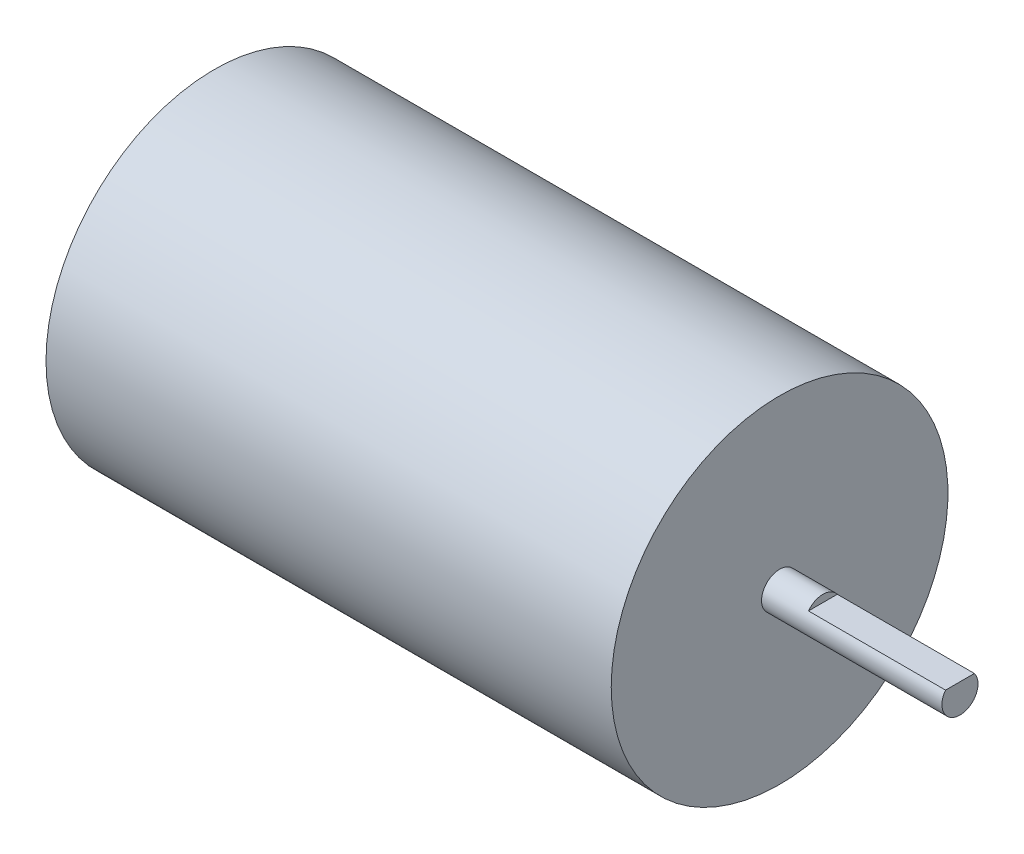
ISO-10303-21;
HEADER;
FILE_DESCRIPTION(('STEP AP214'),'2;1');
FILE_NAME('part.step','',(''),(''),'','','');
FILE_SCHEMA(('AUTOMOTIVE_DESIGN { 1 0 10303 214 1 1 1 1 }'));
ENDSEC;
DATA;
#1=APPLICATION_CONTEXT('core data for automotive mechanical design processes');
#2=APPLICATION_PROTOCOL_DEFINITION('international standard','automotive_design',2000,#1);
#3=PRODUCT_CONTEXT('',#1,'mechanical');
#4=PRODUCT('Part','Part','',(#3));
#5=PRODUCT_RELATED_PRODUCT_CATEGORY('part','',(#4));
#6=PRODUCT_DEFINITION_FORMATION('','',#4);
#7=PRODUCT_DEFINITION_CONTEXT('part definition',#1,'design');
#8=PRODUCT_DEFINITION('design','',#6,#7);
#9=PRODUCT_DEFINITION_SHAPE('','',#8);
#10=(LENGTH_UNIT() NAMED_UNIT(*) SI_UNIT(.MILLI.,.METRE.));
#11=(NAMED_UNIT(*) PLANE_ANGLE_UNIT() SI_UNIT($,.RADIAN.));
#12=(NAMED_UNIT(*) SI_UNIT($,.STERADIAN.) SOLID_ANGLE_UNIT());
#13=UNCERTAINTY_MEASURE_WITH_UNIT(LENGTH_MEASURE(1.E-05),#10,'distance_accuracy_value','');
#14=(GEOMETRIC_REPRESENTATION_CONTEXT(3) GLOBAL_UNCERTAINTY_ASSIGNED_CONTEXT((#13)) GLOBAL_UNIT_ASSIGNED_CONTEXT((#10,
#11,#12)) REPRESENTATION_CONTEXT('',''));
#15=CARTESIAN_POINT('',(0.,0.,0.));
#16=DIRECTION('',(0.,0.,1.));
#17=DIRECTION('',(1.,0.,0.));
#18=AXIS2_PLACEMENT_3D('',#15,#16,#17);
#19=CARTESIAN_POINT('',(0.,0.,0.));
#20=DIRECTION('',(1.,0.,0.));
#21=DIRECTION('',(0.,0.,-1.));
#22=AXIS2_PLACEMENT_3D('',#19,#20,#21);
#23=PLANE('',#22);
#24=CARTESIAN_POINT('',(0.,0.,0.));
#25=DIRECTION('',(-1.,0.,0.));
#26=DIRECTION('',(0.,0.,1.));
#27=AXIS2_PLACEMENT_3D('',#24,#25,#26);
#28=CIRCLE('',#27,14.);
#29=CARTESIAN_POINT('',(0.,0.,14.));
#30=VERTEX_POINT('',#29);
#31=EDGE_CURVE('E44',#30,#30,#28,.T.);
#32=ORIENTED_EDGE('',*,*,#31,.T.);
#33=EDGE_LOOP('',(#32));
#34=FACE_BOUND('',#33,.T.);
#35=ADVANCED_FACE('F37',(#34),#23,.F.);
#36=CARTESIAN_POINT('',(0.,0.,0.));
#37=DIRECTION('',(-1.,0.,0.));
#38=DIRECTION('',(0.,0.,1.));
#39=AXIS2_PLACEMENT_3D('',#36,#37,#38);
#40=CYLINDRICAL_SURFACE('',#39,14.);
#41=ORIENTED_EDGE('',*,*,#31,.F.);
#42=EDGE_LOOP('',(#41));
#43=FACE_BOUND('',#42,.T.);
#44=CARTESIAN_POINT('',(47.,0.,0.));
#45=DIRECTION('',(-1.,0.,0.));
#46=DIRECTION('',(0.,0.,1.));
#47=AXIS2_PLACEMENT_3D('',#44,#45,#46);
#48=CIRCLE('',#47,14.);
#49=CARTESIAN_POINT('',(47.,0.,14.));
#50=VERTEX_POINT('',#49);
#51=EDGE_CURVE('E76',#50,#50,#48,.T.);
#52=ORIENTED_EDGE('',*,*,#51,.T.);
#53=EDGE_LOOP('',(#52));
#54=FACE_BOUND('',#53,.T.);
#55=ADVANCED_FACE('F85',(#43,#54),#40,.T.);
#56=CARTESIAN_POINT('',(47.,0.,0.));
#57=DIRECTION('',(-1.,0.,0.));
#58=DIRECTION('',(0.,0.,1.));
#59=AXIS2_PLACEMENT_3D('',#56,#57,#58);
#60=PLANE('',#59);
#61=CARTESIAN_POINT('',(47.,0.,0.));
#62=DIRECTION('',(-1.,0.,0.));
#63=DIRECTION('',(0.,0.,1.));
#64=AXIS2_PLACEMENT_3D('',#61,#62,#63);
#65=CIRCLE('',#64,1.5);
#66=CARTESIAN_POINT('',(47.,0.,1.5));
#67=VERTEX_POINT('',#66);
#68=EDGE_CURVE('E11',#67,#67,#65,.F.);
#69=ORIENTED_EDGE('',*,*,#68,.F.);
#70=EDGE_LOOP('',(#69));
#71=FACE_BOUND('',#70,.T.);
#72=ORIENTED_EDGE('',*,*,#51,.F.);
#73=EDGE_LOOP('',(#72));
#74=FACE_BOUND('',#73,.T.);
#75=ADVANCED_FACE('F88',(#71,#74),#60,.F.);
#76=CARTESIAN_POINT('',(62.,0.,0.));
#77=DIRECTION('',(-1.,0.,0.));
#78=DIRECTION('',(0.,0.,1.));
#79=AXIS2_PLACEMENT_3D('',#76,#77,#78);
#80=CYLINDRICAL_SURFACE('',#79,1.5);
#81=CARTESIAN_POINT('',(62.,0.,0.));
#82=DIRECTION('',(1.,0.,0.));
#83=DIRECTION('',(0.,0.,-1.));
#84=AXIS2_PLACEMENT_3D('',#81,#82,#83);
#85=CIRCLE('',#84,1.5);
#86=CARTESIAN_POINT('',(62.,0.9,1.2));
#87=VERTEX_POINT('',#86);
#88=CARTESIAN_POINT('',(62.,0.9,-1.2));
#89=VERTEX_POINT('',#88);
#90=EDGE_CURVE('E73',#87,#89,#85,.T.);
#91=ORIENTED_EDGE('',*,*,#90,.F.);
#92=DIRECTION('',(1.,0.,0.));
#93=VECTOR('',#92,1.);
#94=CARTESIAN_POINT('',(50.6,0.9,1.2));
#95=LINE('',#94,#93);
#96=CARTESIAN_POINT('',(50.6,0.9,1.2));
#97=VERTEX_POINT('',#96);
#98=EDGE_CURVE('E51',#97,#87,#95,.T.);
#99=ORIENTED_EDGE('',*,*,#98,.F.);
#100=CARTESIAN_POINT('',(50.6,0.,0.));
#101=DIRECTION('',(1.,0.,0.));
#102=DIRECTION('',(0.,0.,-1.));
#103=AXIS2_PLACEMENT_3D('',#100,#101,#102);
#104=CIRCLE('',#103,1.5);
#105=CARTESIAN_POINT('',(50.6,0.9,-1.2));
#106=VERTEX_POINT('',#105);
#107=EDGE_CURVE('E67',#106,#97,#104,.T.);
#108=ORIENTED_EDGE('',*,*,#107,.F.);
#109=DIRECTION('',(1.,0.,0.));
#110=VECTOR('',#109,1.);
#111=CARTESIAN_POINT('',(50.6,0.9,-1.2));
#112=LINE('',#111,#110);
#113=EDGE_CURVE('E57',#106,#89,#112,.T.);
#114=ORIENTED_EDGE('',*,*,#113,.T.);
#115=EDGE_LOOP('',(#91,#99,#108,#114));
#116=FACE_BOUND('',#115,.T.);
#117=ORIENTED_EDGE('',*,*,#68,.T.);
#118=EDGE_LOOP('',(#117));
#119=FACE_BOUND('',#118,.T.);
#120=ADVANCED_FACE('F71',(#116,#119),#80,.T.);
#121=CARTESIAN_POINT('',(62.,0.,0.));
#122=DIRECTION('',(1.,0.,0.));
#123=DIRECTION('',(0.,0.,-1.));
#124=AXIS2_PLACEMENT_3D('',#121,#122,#123);
#125=PLANE('',#124);
#126=DIRECTION('',(0.,0.,-1.));
#127=VECTOR('',#126,1.);
#128=CARTESIAN_POINT('',(62.,0.9,1.2));
#129=LINE('',#128,#127);
#130=EDGE_CURVE('E62',#87,#89,#129,.T.);
#131=ORIENTED_EDGE('',*,*,#130,.F.);
#132=ORIENTED_EDGE('',*,*,#90,.T.);
#133=EDGE_LOOP('',(#131,#132));
#134=FACE_BOUND('',#133,.T.);
#135=ADVANCED_FACE('F75',(#134),#125,.T.);
#136=CARTESIAN_POINT('',(50.6,0.9,1.2));
#137=DIRECTION('',(0.,-1.,0.));
#138=DIRECTION('',(0.,0.,-1.));
#139=AXIS2_PLACEMENT_3D('',#136,#137,#138);
#140=PLANE('',#139);
#141=ORIENTED_EDGE('',*,*,#130,.T.);
#142=ORIENTED_EDGE('',*,*,#113,.F.);
#143=DIRECTION('',(0.,0.,-1.));
#144=VECTOR('',#143,1.);
#145=CARTESIAN_POINT('',(50.6,0.9,1.2));
#146=LINE('',#145,#144);
#147=EDGE_CURVE('E162',#97,#106,#146,.T.);
#148=ORIENTED_EDGE('',*,*,#147,.F.);
#149=ORIENTED_EDGE('',*,*,#98,.T.);
#150=EDGE_LOOP('',(#141,#142,#148,#149));
#151=FACE_BOUND('',#150,.T.);
#152=ADVANCED_FACE('F63',(#151),#140,.F.);
#153=CARTESIAN_POINT('',(50.6,0.,0.));
#154=DIRECTION('',(1.,0.,0.));
#155=DIRECTION('',(0.,0.,-1.));
#156=AXIS2_PLACEMENT_3D('',#153,#154,#155);
#157=PLANE('',#156);
#158=ORIENTED_EDGE('',*,*,#107,.T.);
#159=ORIENTED_EDGE('',*,*,#147,.T.);
#160=EDGE_LOOP('',(#158,#159));
#161=FACE_BOUND('',#160,.T.);
#162=ADVANCED_FACE('F137',(#161),#157,.T.);
#163=CLOSED_SHELL('',(#35,#55,#75,#120,#135,#152,#162));
#164=MANIFOLD_SOLID_BREP('B2',#163);
#165=ADVANCED_BREP_SHAPE_REPRESENTATION('',(#18,#164),#14);
#166=SHAPE_DEFINITION_REPRESENTATION(#9,#165);
ENDSEC;
END-ISO-10303-21;
